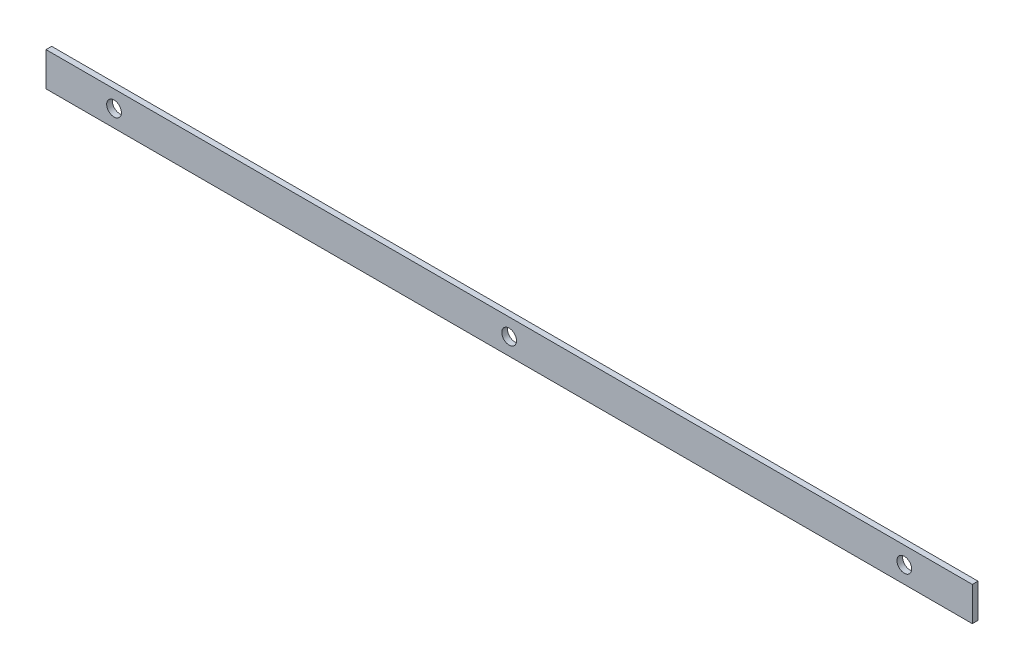
ISO-10303-21;
HEADER;
FILE_DESCRIPTION(('STEP AP214'),'2;1');
FILE_NAME('part.step','',(''),(''),'','','');
FILE_SCHEMA(('AUTOMOTIVE_DESIGN { 1 0 10303 214 1 1 1 1 }'));
ENDSEC;
DATA;
#1=APPLICATION_CONTEXT('core data for automotive mechanical design processes');
#2=APPLICATION_PROTOCOL_DEFINITION('international standard','automotive_design',2000,#1);
#3=PRODUCT_CONTEXT('',#1,'mechanical');
#4=PRODUCT('Part','Part','',(#3));
#5=PRODUCT_RELATED_PRODUCT_CATEGORY('part','',(#4));
#6=PRODUCT_DEFINITION_FORMATION('','',#4);
#7=PRODUCT_DEFINITION_CONTEXT('part definition',#1,'design');
#8=PRODUCT_DEFINITION('design','',#6,#7);
#9=PRODUCT_DEFINITION_SHAPE('','',#8);
#10=(LENGTH_UNIT() NAMED_UNIT(*) SI_UNIT(.MILLI.,.METRE.));
#11=(NAMED_UNIT(*) PLANE_ANGLE_UNIT() SI_UNIT($,.RADIAN.));
#12=(NAMED_UNIT(*) SI_UNIT($,.STERADIAN.) SOLID_ANGLE_UNIT());
#13=UNCERTAINTY_MEASURE_WITH_UNIT(LENGTH_MEASURE(1.E-05),#10,'distance_accuracy_value','');
#14=(GEOMETRIC_REPRESENTATION_CONTEXT(3) GLOBAL_UNCERTAINTY_ASSIGNED_CONTEXT((#13)) GLOBAL_UNIT_ASSIGNED_CONTEXT((#10,
#11,#12)) REPRESENTATION_CONTEXT('',''));
#15=CARTESIAN_POINT('',(0.,0.,0.));
#16=DIRECTION('',(0.,0.,1.));
#17=DIRECTION('',(1.,0.,0.));
#18=AXIS2_PLACEMENT_3D('',#15,#16,#17);
#19=CARTESIAN_POINT('',(348.5,0.,-2.5));
#20=DIRECTION('',(0.,0.,-1.));
#21=DIRECTION('',(-1.,0.,0.));
#22=AXIS2_PLACEMENT_3D('',#19,#20,#21);
#23=CYLINDRICAL_SURFACE('',#22,6.50000000000001);
#24=CARTESIAN_POINT('',(348.5,0.,2.5));
#25=DIRECTION('',(0.,0.,-1.));
#26=DIRECTION('',(-1.,0.,0.));
#27=AXIS2_PLACEMENT_3D('',#24,#25,#26);
#28=CIRCLE('',#27,6.50000000000001);
#29=CARTESIAN_POINT('',(342.,0.,2.5));
#30=VERTEX_POINT('',#29);
#31=EDGE_CURVE('E57',#30,#30,#28,.T.);
#32=ORIENTED_EDGE('',*,*,#31,.F.);
#33=EDGE_LOOP('',(#32));
#34=FACE_BOUND('',#33,.T.);
#35=CARTESIAN_POINT('',(348.5,0.,-2.5));
#36=DIRECTION('',(0.,0.,-1.));
#37=DIRECTION('',(-1.,0.,0.));
#38=AXIS2_PLACEMENT_3D('',#35,#36,#37);
#39=CIRCLE('',#38,6.50000000000001);
#40=CARTESIAN_POINT('',(342.,0.,-2.5));
#41=VERTEX_POINT('',#40);
#42=EDGE_CURVE('E12',#41,#41,#39,.T.);
#43=ORIENTED_EDGE('',*,*,#42,.T.);
#44=EDGE_LOOP('',(#43));
#45=FACE_BOUND('',#44,.T.);
#46=ADVANCED_FACE('F49',(#34,#45),#23,.F.);
#47=CARTESIAN_POINT('',(408.5,-15.,2.5));
#48=DIRECTION('',(0.,1.,0.));
#49=DIRECTION('',(0.,0.,1.));
#50=AXIS2_PLACEMENT_3D('',#47,#48,#49);
#51=PLANE('',#50);
#52=DIRECTION('',(0.,0.,-1.));
#53=VECTOR('',#52,1.);
#54=CARTESIAN_POINT('',(-408.5,-15.,2.5));
#55=LINE('',#54,#53);
#56=CARTESIAN_POINT('',(-408.5,-15.,2.5));
#57=VERTEX_POINT('',#56);
#58=CARTESIAN_POINT('',(-408.5,-15.,-2.5));
#59=VERTEX_POINT('',#58);
#60=EDGE_CURVE('E117',#57,#59,#55,.T.);
#61=ORIENTED_EDGE('',*,*,#60,.T.);
#62=DIRECTION('',(-1.,0.,0.));
#63=VECTOR('',#62,1.);
#64=CARTESIAN_POINT('',(408.5,-15.,-2.5));
#65=LINE('',#64,#63);
#66=CARTESIAN_POINT('',(408.5,-15.,-2.5));
#67=VERTEX_POINT('',#66);
#68=EDGE_CURVE('E108',#67,#59,#65,.T.);
#69=ORIENTED_EDGE('',*,*,#68,.F.);
#70=DIRECTION('',(0.,0.,-1.));
#71=VECTOR('',#70,1.);
#72=CARTESIAN_POINT('',(408.5,-15.,2.5));
#73=LINE('',#72,#71);
#74=CARTESIAN_POINT('',(408.5,-15.,2.5));
#75=VERTEX_POINT('',#74);
#76=EDGE_CURVE('E101',#75,#67,#73,.T.);
#77=ORIENTED_EDGE('',*,*,#76,.F.);
#78=DIRECTION('',(-1.,0.,0.));
#79=VECTOR('',#78,1.);
#80=CARTESIAN_POINT('',(408.5,-15.,2.5));
#81=LINE('',#80,#79);
#82=EDGE_CURVE('E113',#75,#57,#81,.T.);
#83=ORIENTED_EDGE('',*,*,#82,.T.);
#84=EDGE_LOOP('',(#61,#69,#77,#83));
#85=FACE_BOUND('',#84,.T.);
#86=ADVANCED_FACE('F133',(#85),#51,.F.);
#87=CARTESIAN_POINT('',(408.5,-15.,-2.5));
#88=DIRECTION('',(0.,0.,1.));
#89=DIRECTION('',(1.,0.,0.));
#90=AXIS2_PLACEMENT_3D('',#87,#88,#89);
#91=PLANE('',#90);
#92=CARTESIAN_POINT('',(0.,0.,-2.5));
#93=DIRECTION('',(0.,0.,-1.));
#94=DIRECTION('',(-1.,0.,0.));
#95=AXIS2_PLACEMENT_3D('',#92,#93,#94);
#96=CIRCLE('',#95,6.50000000000001);
#97=CARTESIAN_POINT('',(-6.50000000000006,0.,-2.5));
#98=VERTEX_POINT('',#97);
#99=EDGE_CURVE('E170',#98,#98,#96,.T.);
#100=ORIENTED_EDGE('',*,*,#99,.F.);
#101=EDGE_LOOP('',(#100));
#102=FACE_BOUND('',#101,.T.);
#103=CARTESIAN_POINT('',(-348.5,0.,-2.5));
#104=DIRECTION('',(0.,0.,-1.));
#105=DIRECTION('',(-1.,0.,0.));
#106=AXIS2_PLACEMENT_3D('',#103,#104,#105);
#107=CIRCLE('',#106,6.50000000000001);
#108=CARTESIAN_POINT('',(-355.,0.,-2.5));
#109=VERTEX_POINT('',#108);
#110=EDGE_CURVE('E171',#109,#109,#107,.T.);
#111=ORIENTED_EDGE('',*,*,#110,.F.);
#112=EDGE_LOOP('',(#111));
#113=FACE_BOUND('',#112,.T.);
#114=DIRECTION('',(0.,1.,0.));
#115=VECTOR('',#114,1.);
#116=CARTESIAN_POINT('',(-408.5,-15.,-2.5));
#117=LINE('',#116,#115);
#118=CARTESIAN_POINT('',(-408.5,15.,-2.5));
#119=VERTEX_POINT('',#118);
#120=EDGE_CURVE('E107',#59,#119,#117,.T.);
#121=ORIENTED_EDGE('',*,*,#120,.T.);
#122=DIRECTION('',(-1.,0.,0.));
#123=VECTOR('',#122,1.);
#124=CARTESIAN_POINT('',(408.5,15.,-2.5));
#125=LINE('',#124,#123);
#126=CARTESIAN_POINT('',(408.5,15.,-2.5));
#127=VERTEX_POINT('',#126);
#128=EDGE_CURVE('E104',#127,#119,#125,.T.);
#129=ORIENTED_EDGE('',*,*,#128,.F.);
#130=DIRECTION('',(0.,1.,0.));
#131=VECTOR('',#130,1.);
#132=CARTESIAN_POINT('',(408.5,-15.,-2.5));
#133=LINE('',#132,#131);
#134=EDGE_CURVE('E96',#67,#127,#133,.T.);
#135=ORIENTED_EDGE('',*,*,#134,.F.);
#136=ORIENTED_EDGE('',*,*,#68,.T.);
#137=EDGE_LOOP('',(#121,#129,#135,#136));
#138=FACE_BOUND('',#137,.T.);
#139=ORIENTED_EDGE('',*,*,#42,.F.);
#140=EDGE_LOOP('',(#139));
#141=FACE_BOUND('',#140,.T.);
#142=ADVANCED_FACE('F105',(#102,#113,#138,#141),#91,.F.);
#143=CARTESIAN_POINT('',(408.5,15.,2.5));
#144=DIRECTION('',(0.,-1.,0.));
#145=DIRECTION('',(0.,0.,-1.));
#146=AXIS2_PLACEMENT_3D('',#143,#144,#145);
#147=PLANE('',#146);
#148=DIRECTION('',(0.,0.,1.));
#149=VECTOR('',#148,1.);
#150=CARTESIAN_POINT('',(-408.5,15.,2.5));
#151=LINE('',#150,#149);
#152=CARTESIAN_POINT('',(-408.5,15.,2.5));
#153=VERTEX_POINT('',#152);
#154=EDGE_CURVE('E82',#119,#153,#151,.T.);
#155=ORIENTED_EDGE('',*,*,#154,.T.);
#156=DIRECTION('',(-1.,0.,0.));
#157=VECTOR('',#156,1.);
#158=CARTESIAN_POINT('',(408.5,15.,2.5));
#159=LINE('',#158,#157);
#160=CARTESIAN_POINT('',(408.5,15.,2.5));
#161=VERTEX_POINT('',#160);
#162=EDGE_CURVE('E109',#161,#153,#159,.T.);
#163=ORIENTED_EDGE('',*,*,#162,.F.);
#164=DIRECTION('',(0.,0.,1.));
#165=VECTOR('',#164,1.);
#166=CARTESIAN_POINT('',(408.5,15.,2.5));
#167=LINE('',#166,#165);
#168=EDGE_CURVE('E99',#127,#161,#167,.T.);
#169=ORIENTED_EDGE('',*,*,#168,.F.);
#170=ORIENTED_EDGE('',*,*,#128,.T.);
#171=EDGE_LOOP('',(#155,#163,#169,#170));
#172=FACE_BOUND('',#171,.T.);
#173=ADVANCED_FACE('F111',(#172),#147,.F.);
#174=CARTESIAN_POINT('',(408.5,-15.,2.5));
#175=DIRECTION('',(0.,0.,-1.));
#176=DIRECTION('',(-1.,0.,0.));
#177=AXIS2_PLACEMENT_3D('',#174,#175,#176);
#178=PLANE('',#177);
#179=CARTESIAN_POINT('',(0.,0.,2.5));
#180=DIRECTION('',(0.,0.,-1.));
#181=DIRECTION('',(-1.,0.,0.));
#182=AXIS2_PLACEMENT_3D('',#179,#180,#181);
#183=CIRCLE('',#182,6.50000000000001);
#184=CARTESIAN_POINT('',(-6.50000000000006,0.,2.5));
#185=VERTEX_POINT('',#184);
#186=EDGE_CURVE('E168',#185,#185,#183,.T.);
#187=ORIENTED_EDGE('',*,*,#186,.T.);
#188=EDGE_LOOP('',(#187));
#189=FACE_BOUND('',#188,.T.);
#190=CARTESIAN_POINT('',(-348.5,0.,2.5));
#191=DIRECTION('',(0.,0.,-1.));
#192=DIRECTION('',(-1.,0.,0.));
#193=AXIS2_PLACEMENT_3D('',#190,#191,#192);
#194=CIRCLE('',#193,6.50000000000001);
#195=CARTESIAN_POINT('',(-355.,0.,2.5));
#196=VERTEX_POINT('',#195);
#197=EDGE_CURVE('E120',#196,#196,#194,.T.);
#198=ORIENTED_EDGE('',*,*,#197,.T.);
#199=EDGE_LOOP('',(#198));
#200=FACE_BOUND('',#199,.T.);
#201=DIRECTION('',(0.,-1.,0.));
#202=VECTOR('',#201,1.);
#203=CARTESIAN_POINT('',(-408.5,-15.,2.5));
#204=LINE('',#203,#202);
#205=EDGE_CURVE('E88',#153,#57,#204,.T.);
#206=ORIENTED_EDGE('',*,*,#205,.T.);
#207=ORIENTED_EDGE('',*,*,#82,.F.);
#208=DIRECTION('',(0.,-1.,0.));
#209=VECTOR('',#208,1.);
#210=CARTESIAN_POINT('',(408.5,-15.,2.5));
#211=LINE('',#210,#209);
#212=EDGE_CURVE('E65',#161,#75,#211,.T.);
#213=ORIENTED_EDGE('',*,*,#212,.F.);
#214=ORIENTED_EDGE('',*,*,#162,.T.);
#215=EDGE_LOOP('',(#206,#207,#213,#214));
#216=FACE_BOUND('',#215,.T.);
#217=ORIENTED_EDGE('',*,*,#31,.T.);
#218=EDGE_LOOP('',(#217));
#219=FACE_BOUND('',#218,.T.);
#220=ADVANCED_FACE('F129',(#189,#200,#216,#219),#178,.F.);
#221=CARTESIAN_POINT('',(408.5,-15.,-2.5));
#222=DIRECTION('',(1.,0.,0.));
#223=DIRECTION('',(0.,0.,-1.));
#224=AXIS2_PLACEMENT_3D('',#221,#222,#223);
#225=PLANE('',#224);
#226=ORIENTED_EDGE('',*,*,#76,.T.);
#227=ORIENTED_EDGE('',*,*,#134,.T.);
#228=ORIENTED_EDGE('',*,*,#168,.T.);
#229=ORIENTED_EDGE('',*,*,#212,.T.);
#230=EDGE_LOOP('',(#226,#227,#228,#229));
#231=FACE_BOUND('',#230,.T.);
#232=ADVANCED_FACE('F97',(#231),#225,.T.);
#233=CARTESIAN_POINT('',(-408.5,-15.,-2.5));
#234=DIRECTION('',(1.,0.,0.));
#235=DIRECTION('',(0.,0.,-1.));
#236=AXIS2_PLACEMENT_3D('',#233,#234,#235);
#237=PLANE('',#236);
#238=ORIENTED_EDGE('',*,*,#60,.F.);
#239=ORIENTED_EDGE('',*,*,#205,.F.);
#240=ORIENTED_EDGE('',*,*,#154,.F.);
#241=ORIENTED_EDGE('',*,*,#120,.F.);
#242=EDGE_LOOP('',(#238,#239,#240,#241));
#243=FACE_BOUND('',#242,.T.);
#244=ADVANCED_FACE('F150',(#243),#237,.F.);
#245=CARTESIAN_POINT('',(-348.5,0.,-2.5));
#246=DIRECTION('',(0.,0.,-1.));
#247=DIRECTION('',(-1.,0.,0.));
#248=AXIS2_PLACEMENT_3D('',#245,#246,#247);
#249=CYLINDRICAL_SURFACE('',#248,6.50000000000001);
#250=ORIENTED_EDGE('',*,*,#197,.F.);
#251=EDGE_LOOP('',(#250));
#252=FACE_BOUND('',#251,.T.);
#253=ORIENTED_EDGE('',*,*,#110,.T.);
#254=EDGE_LOOP('',(#253));
#255=FACE_BOUND('',#254,.T.);
#256=ADVANCED_FACE('F153',(#252,#255),#249,.F.);
#257=CARTESIAN_POINT('',(0.,0.,-2.5));
#258=DIRECTION('',(0.,0.,-1.));
#259=DIRECTION('',(-1.,0.,0.));
#260=AXIS2_PLACEMENT_3D('',#257,#258,#259);
#261=CYLINDRICAL_SURFACE('',#260,6.50000000000001);
#262=ORIENTED_EDGE('',*,*,#186,.F.);
#263=EDGE_LOOP('',(#262));
#264=FACE_BOUND('',#263,.T.);
#265=ORIENTED_EDGE('',*,*,#99,.T.);
#266=EDGE_LOOP('',(#265));
#267=FACE_BOUND('',#266,.T.);
#268=ADVANCED_FACE('F159',(#264,#267),#261,.F.);
#269=CLOSED_SHELL('',(#46,#86,#142,#173,#220,#232,#244,#256,#268));
#270=MANIFOLD_SOLID_BREP('B2',#269);
#271=ADVANCED_BREP_SHAPE_REPRESENTATION('',(#18,#270),#14);
#272=SHAPE_DEFINITION_REPRESENTATION(#9,#271);
ENDSEC;
END-ISO-10303-21;
